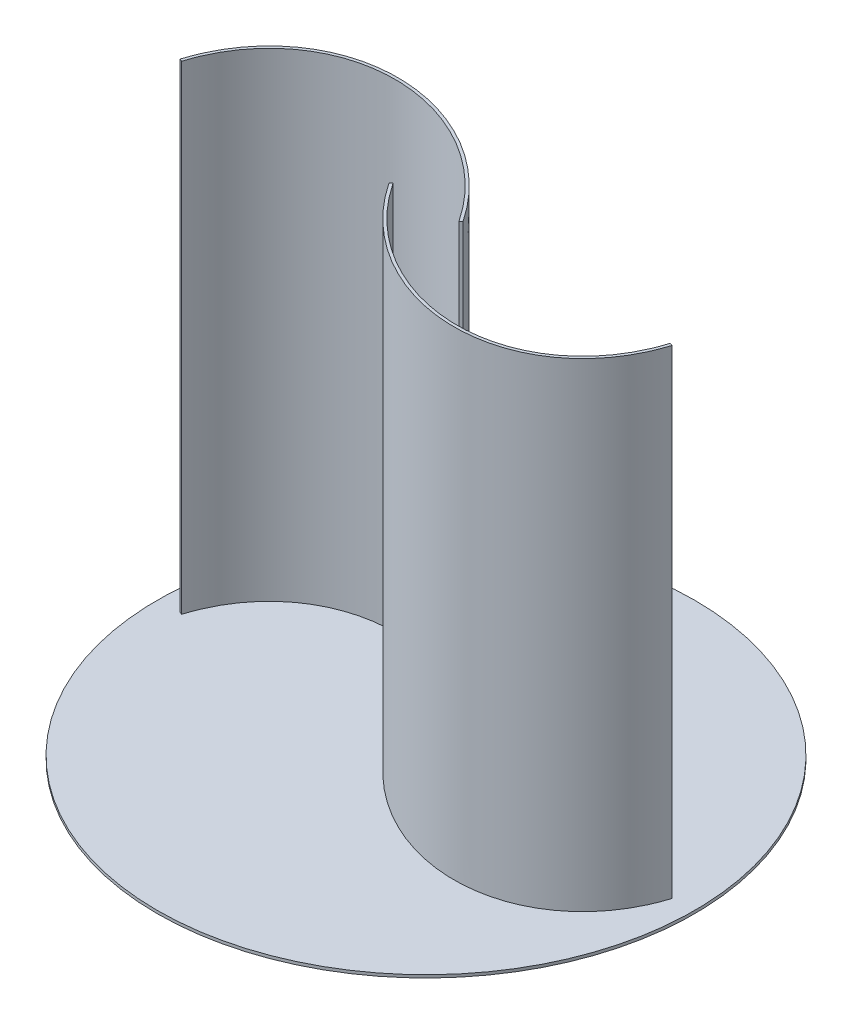
ISO-10303-21;
HEADER;
FILE_DESCRIPTION(('STEP AP214'),'2;1');
FILE_NAME('part.step','',(''),(''),'','','');
FILE_SCHEMA(('AUTOMOTIVE_DESIGN { 1 0 10303 214 1 1 1 1 }'));
ENDSEC;
DATA;
#1=APPLICATION_CONTEXT('core data for automotive mechanical design processes');
#2=APPLICATION_PROTOCOL_DEFINITION('international standard','automotive_design',2000,#1);
#3=PRODUCT_CONTEXT('',#1,'mechanical');
#4=PRODUCT('Part','Part','',(#3));
#5=PRODUCT_RELATED_PRODUCT_CATEGORY('part','',(#4));
#6=PRODUCT_DEFINITION_FORMATION('','',#4);
#7=PRODUCT_DEFINITION_CONTEXT('part definition',#1,'design');
#8=PRODUCT_DEFINITION('design','',#6,#7);
#9=PRODUCT_DEFINITION_SHAPE('','',#8);
#10=(LENGTH_UNIT() NAMED_UNIT(*) SI_UNIT(.MILLI.,.METRE.));
#11=(NAMED_UNIT(*) PLANE_ANGLE_UNIT() SI_UNIT($,.RADIAN.));
#12=(NAMED_UNIT(*) SI_UNIT($,.STERADIAN.) SOLID_ANGLE_UNIT());
#13=UNCERTAINTY_MEASURE_WITH_UNIT(LENGTH_MEASURE(1.E-05),#10,'distance_accuracy_value','');
#14=(GEOMETRIC_REPRESENTATION_CONTEXT(3) GLOBAL_UNCERTAINTY_ASSIGNED_CONTEXT((#13)) GLOBAL_UNIT_ASSIGNED_CONTEXT((#10,
#11,#12)) REPRESENTATION_CONTEXT('',''));
#15=CARTESIAN_POINT('',(0.,0.,0.));
#16=DIRECTION('',(0.,0.,1.));
#17=DIRECTION('',(1.,0.,0.));
#18=AXIS2_PLACEMENT_3D('',#15,#16,#17);
#19=CARTESIAN_POINT('',(0.,0.,0.));
#20=DIRECTION('',(0.,-1.,0.));
#21=DIRECTION('',(0.,0.,-1.));
#22=AXIS2_PLACEMENT_3D('',#19,#20,#21);
#23=PLANE('',#22);
#24=CARTESIAN_POINT('',(0.,0.,0.));
#25=DIRECTION('',(0.,-1.,0.));
#26=DIRECTION('',(0.,0.,-1.));
#27=AXIS2_PLACEMENT_3D('',#24,#25,#26);
#28=CIRCLE('',#27,280.5);
#29=CARTESIAN_POINT('',(0.,0.,-280.5));
#30=VERTEX_POINT('',#29);
#31=EDGE_CURVE('E133',#30,#30,#28,.T.);
#32=ORIENTED_EDGE('',*,*,#31,.F.);
#33=EDGE_LOOP('',(#32));
#34=FACE_BOUND('',#33,.T.);
#35=CARTESIAN_POINT('',(36.9223833949054,0.,-1.66225033579514));
#36=CARTESIAN_POINT('',(32.1145448737323,0.,-8.88560041105333));
#37=CARTESIAN_POINT('',(26.9057075588339,0.,-15.8486757948092));
#38=CARTESIAN_POINT('',(15.7797891104791,0.,-29.1287346442623));
#39=CARTESIAN_POINT('',(9.86276594350617,0.,-35.4456489187779));
#40=CARTESIAN_POINT('',(-2.5732099280169,0.,-47.3190178128574));
#41=CARTESIAN_POINT('',(-9.09209868150903,0.,-52.8754110669405));
#42=CARTESIAN_POINT('',(-22.6148675451389,0.,-63.126659855601));
#43=CARTESIAN_POINT('',(-29.6186799302953,0.,-67.8214627617948));
#44=CARTESIAN_POINT('',(-43.9857181311514,0.,-76.2634551352371));
#45=CARTESIAN_POINT('',(-51.3488748683971,0.,-80.0106006310496));
#46=CARTESIAN_POINT('',(-66.3024456009143,0.,-86.4876522935036));
#47=CARTESIAN_POINT('',(-73.8927911983566,0.,-89.2175217011221));
#48=CARTESIAN_POINT('',(-89.1640743874773,0.,-93.6080489411739));
#49=CARTESIAN_POINT('',(-96.844944697979,0.,-95.2686743866091));
#50=CARTESIAN_POINT('',(-112.158137305376,0.,-97.4874201525338));
#51=CARTESIAN_POINT('',(-119.790390591836,0.,-98.0455093656684));
#52=CARTESIAN_POINT('',(-134.866763518416,0.,-98.0455093656684));
#53=CARTESIAN_POINT('',(-142.310805471188,0.,-97.4873901669953));
#54=CARTESIAN_POINT('',(-156.872894422027,0.,-95.2618416541669));
#55=CARTESIAN_POINT('',(-163.990846834994,0.,-93.5943906086649));
#56=CARTESIAN_POINT('',(-177.767174384892,0.,-89.1784010023347));
#57=CARTESIAN_POINT('',(-184.425436499561,0.,-86.4298642157199));
#58=CARTESIAN_POINT('',(-197.156200496992,0.,-79.9016439348217));
#59=CARTESIAN_POINT('',(-203.228583716785,0.,-76.1220007985467));
#60=CARTESIAN_POINT('',(-214.672346426108,0.,-67.6026451692365));
#61=CARTESIAN_POINT('',(-220.043625089779,0.,-62.8630128039617));
#62=CARTESIAN_POINT('',(-229.984260691079,0.,-52.5140707922798));
#63=CARTESIAN_POINT('',(-234.553552685352,0.,-46.9048642235047));
#64=CARTESIAN_POINT('',(-242.80616441977,0.,-34.9236545132171));
#65=CARTESIAN_POINT('',(-246.489455429961,0.,-28.5517550158839));
#66=CARTESIAN_POINT('',(-252.90427123467,0.,-15.1653455376847));
#67=CARTESIAN_POINT('',(-255.635790383931,0.,-8.15092709936019));
#68=CARTESIAN_POINT('',(-257.867887256391,0.,-0.880467310369004));
#69=B_SPLINE_CURVE_WITH_KNOTS('',3,(#35,#36,#37,#38,#39,#40,#41,#42,#43,#44,#45,#46,#47,#48,#49,
#50,#51,#52,#53,#54,#55,#56,#57,#58,#59,#60,#61,#62,#63,#64,#65,#66,#67,#68),.UNSPECIFIED.,.F.,
.F.,(4,2,2,2,2,2,2,2,2,2,2,2,2,2,2,2,4),(0.,0.0625,0.125,0.1875,0.25,0.3125,0.375,0.4375,0.5,
0.5625,0.625,0.6875,0.75,0.8125,0.875,0.9375,1.),.UNSPECIFIED.);
#70=CARTESIAN_POINT('',(36.9223833949054,0.,-1.66225033579514));
#71=VERTEX_POINT('',#70);
#72=CARTESIAN_POINT('',(-257.867887256391,0.,-0.880467310369074));
#73=VERTEX_POINT('',#72);
#74=EDGE_CURVE('E187',#71,#73,#69,.T.);
#75=ORIENTED_EDGE('',*,*,#74,.F.);
#76=DIRECTION('',(-0.832461131635115,0.,0.554083445265047));
#77=VECTOR('',#76,1.);
#78=CARTESIAN_POINT('',(36.9223833949054,0.,-1.66225033579514));
#79=LINE('',#78,#77);
#80=CARTESIAN_POINT('',(34.425,0.,0.));
#81=VERTEX_POINT('',#80);
#82=EDGE_CURVE('E201',#71,#81,#79,.T.);
#83=ORIENTED_EDGE('',*,*,#82,.T.);
#84=CARTESIAN_POINT('',(-95.2187468701049,0.,84.0449997440507));
#85=DIRECTION('',(0.,1.,0.));
#86=DIRECTION('',(0.573576436351044,0.,0.819152044288993));
#87=AXIS2_PLACEMENT_3D('',#84,#85,#86);
#88=ELLIPSE('',#87,190.,154.469256869804);
#89=CARTESIAN_POINT('',(-255.,0.,0.));
#90=VERTEX_POINT('',#89);
#91=EDGE_CURVE('E198',#81,#90,#88,.T.);
#92=ORIENTED_EDGE('',*,*,#91,.T.);
#93=DIRECTION('',(-0.955962418797095,0.,-0.293489103456341));
#94=VECTOR('',#93,1.);
#95=CARTESIAN_POINT('',(-255.,0.,0.));
#96=LINE('',#95,#94);
#97=EDGE_CURVE('E191',#90,#73,#96,.T.);
#98=ORIENTED_EDGE('',*,*,#97,.T.);
#99=EDGE_LOOP('',(#75,#83,#92,#98));
#100=FACE_BOUND('',#99,.T.);
#101=CARTESIAN_POINT('',(-36.9223833949054,0.,1.66225033579517));
#102=CARTESIAN_POINT('',(-32.1145448737323,0.,8.88560041105338));
#103=CARTESIAN_POINT('',(-26.9057075588339,0.,15.8486757948092));
#104=CARTESIAN_POINT('',(-15.7797891104791,0.,29.1287346442624));
#105=CARTESIAN_POINT('',(-9.86276594350612,0.,35.445648918778));
#106=CARTESIAN_POINT('',(2.57320992801696,0.,47.3190178128575));
#107=CARTESIAN_POINT('',(9.09209868150902,0.,52.8754110669405));
#108=CARTESIAN_POINT('',(22.6148675451388,0.,63.1266598556011));
#109=CARTESIAN_POINT('',(29.6186799302954,0.,67.8214627617949));
#110=CARTESIAN_POINT('',(43.9857181311515,0.,76.2634551352372));
#111=CARTESIAN_POINT('',(51.3488748683971,0.,80.0106006310497));
#112=CARTESIAN_POINT('',(66.3024456009142,0.,86.4876522935037));
#113=CARTESIAN_POINT('',(73.8927911983566,0.,89.2175217011222));
#114=CARTESIAN_POINT('',(89.1640743874773,0.,93.608048941174));
#115=CARTESIAN_POINT('',(96.8449446979791,0.,95.2686743866092));
#116=CARTESIAN_POINT('',(112.158137305376,0.,97.4874201525339));
#117=CARTESIAN_POINT('',(119.790390591836,0.,98.0455093656685));
#118=CARTESIAN_POINT('',(134.866763518416,0.,98.0455093656685));
#119=CARTESIAN_POINT('',(142.310805471188,0.,97.4873901669954));
#120=CARTESIAN_POINT('',(156.872894422027,0.,95.261841654167));
#121=CARTESIAN_POINT('',(163.990846834994,0.,93.5943906086651));
#122=CARTESIAN_POINT('',(177.767174384892,0.,89.1784010023348));
#123=CARTESIAN_POINT('',(184.425436499561,0.,86.42986421572));
#124=CARTESIAN_POINT('',(197.156200496992,0.,79.9016439348218));
#125=CARTESIAN_POINT('',(203.228583716785,0.,76.1220007985468));
#126=CARTESIAN_POINT('',(214.672346426109,0.,67.6026451692367));
#127=CARTESIAN_POINT('',(220.04362508978,0.,62.8630128039618));
#128=CARTESIAN_POINT('',(229.984260691079,0.,52.5140707922798));
#129=CARTESIAN_POINT('',(234.553552685352,0.,46.9048642235048));
#130=CARTESIAN_POINT('',(242.806164419771,0.,34.9236545132172));
#131=CARTESIAN_POINT('',(246.489455429961,0.,28.551755015884));
#132=CARTESIAN_POINT('',(252.90427123467,0.,15.1653455376848));
#133=CARTESIAN_POINT('',(255.635790383931,0.,8.15092709936034));
#134=CARTESIAN_POINT('',(257.867887256391,0.,0.880467310369101));
#135=B_SPLINE_CURVE_WITH_KNOTS('',3,(#101,#102,#103,#104,#105,#106,#107,#108,#109,#110,#111,
#112,#113,#114,#115,#116,#117,#118,#119,#120,#121,#122,#123,#124,#125,#126,#127,#128,#129,#130,
#131,#132,#133,#134),.UNSPECIFIED.,.F.,.F.,(4,2,2,2,2,2,2,2,2,2,2,2,2,2,2,2,4),(0.,0.0625,0.125,
0.1875,0.25,0.3125,0.375,0.4375,0.5,0.5625,0.625,0.6875,0.75,0.8125,0.875,0.9375,1.),.UNSPECIFIED.);
#136=CARTESIAN_POINT('',(-36.9223833949054,0.,1.66225033579517));
#137=VERTEX_POINT('',#136);
#138=CARTESIAN_POINT('',(257.867887256391,0.,0.880467310369171));
#139=VERTEX_POINT('',#138);
#140=EDGE_CURVE('E129',#137,#139,#135,.T.);
#141=ORIENTED_EDGE('',*,*,#140,.F.);
#142=DIRECTION('',(0.832461131635115,0.,-0.554083445265047));
#143=VECTOR('',#142,1.);
#144=CARTESIAN_POINT('',(-36.9223833949054,0.,1.66225033579517));
#145=LINE('',#144,#143);
#146=CARTESIAN_POINT('',(-34.425,0.,0.));
#147=VERTEX_POINT('',#146);
#148=EDGE_CURVE('E123',#137,#147,#145,.T.);
#149=ORIENTED_EDGE('',*,*,#148,.T.);
#150=CARTESIAN_POINT('',(95.218746870105,0.,-84.0449997440507));
#151=DIRECTION('',(0.,1.,0.));
#152=DIRECTION('',(-0.573576436351045,0.,-0.819152044288993));
#153=AXIS2_PLACEMENT_3D('',#150,#151,#152);
#154=ELLIPSE('',#153,190.,154.469256869804);
#155=CARTESIAN_POINT('',(255.,0.,1.11022302462516E-13));
#156=VERTEX_POINT('',#155);
#157=EDGE_CURVE('E55',#147,#156,#154,.T.);
#158=ORIENTED_EDGE('',*,*,#157,.T.);
#159=DIRECTION('',(0.955962418797093,0.,0.29348910345635));
#160=VECTOR('',#159,1.);
#161=CARTESIAN_POINT('',(255.,0.,1.11022302462516E-13));
#162=LINE('',#161,#160);
#163=EDGE_CURVE('E233',#156,#139,#162,.T.);
#164=ORIENTED_EDGE('',*,*,#163,.T.);
#165=EDGE_LOOP('',(#141,#149,#158,#164));
#166=FACE_BOUND('',#165,.T.);
#167=ADVANCED_FACE('F39',(#34,#100,#166),#23,.F.);
#168=CARTESIAN_POINT('',(36.9223833949054,500.,-1.66225033579514));
#169=CARTESIAN_POINT('',(32.1145448737323,500.,-8.88560041105333));
#170=CARTESIAN_POINT('',(26.9057075588339,500.,-15.8486757948092));
#171=CARTESIAN_POINT('',(15.7797891104791,500.,-29.1287346442623));
#172=CARTESIAN_POINT('',(9.86276594350617,500.,-35.4456489187779));
#173=CARTESIAN_POINT('',(-2.5732099280169,500.,-47.3190178128574));
#174=CARTESIAN_POINT('',(-9.09209868150903,500.,-52.8754110669405));
#175=CARTESIAN_POINT('',(-22.6148675451389,500.,-63.126659855601));
#176=CARTESIAN_POINT('',(-29.6186799302953,500.,-67.8214627617948));
#177=CARTESIAN_POINT('',(-43.9857181311514,500.,-76.2634551352371));
#178=CARTESIAN_POINT('',(-51.3488748683971,500.,-80.0106006310496));
#179=CARTESIAN_POINT('',(-66.3024456009143,500.,-86.4876522935036));
#180=CARTESIAN_POINT('',(-73.8927911983566,500.,-89.2175217011221));
#181=CARTESIAN_POINT('',(-89.1640743874773,500.,-93.6080489411739));
#182=CARTESIAN_POINT('',(-96.844944697979,500.,-95.2686743866091));
#183=CARTESIAN_POINT('',(-112.158137305376,500.,-97.4874201525338));
#184=CARTESIAN_POINT('',(-119.790390591836,500.,-98.0455093656684));
#185=CARTESIAN_POINT('',(-134.866763518416,500.,-98.0455093656684));
#186=CARTESIAN_POINT('',(-142.310805471188,500.,-97.4873901669953));
#187=CARTESIAN_POINT('',(-156.872894422027,500.,-95.2618416541669));
#188=CARTESIAN_POINT('',(-163.990846834994,500.,-93.5943906086649));
#189=CARTESIAN_POINT('',(-177.767174384892,500.,-89.1784010023347));
#190=CARTESIAN_POINT('',(-184.425436499561,500.,-86.4298642157199));
#191=CARTESIAN_POINT('',(-197.156200496992,500.,-79.9016439348217));
#192=CARTESIAN_POINT('',(-203.228583716785,500.,-76.1220007985467));
#193=CARTESIAN_POINT('',(-214.672346426108,500.,-67.6026451692365));
#194=CARTESIAN_POINT('',(-220.043625089779,500.,-62.8630128039617));
#195=CARTESIAN_POINT('',(-229.984260691079,500.,-52.5140707922798));
#196=CARTESIAN_POINT('',(-234.553552685352,500.,-46.9048642235047));
#197=CARTESIAN_POINT('',(-242.80616441977,500.,-34.9236545132171));
#198=CARTESIAN_POINT('',(-246.489455429961,500.,-28.5517550158839));
#199=CARTESIAN_POINT('',(-252.90427123467,500.,-15.1653455376847));
#200=CARTESIAN_POINT('',(-255.635790383931,500.,-8.15092709936019));
#201=CARTESIAN_POINT('',(-257.867887256391,500.,-0.880467310369004));
#202=B_SPLINE_CURVE_WITH_KNOTS('',3,(#168,#169,#170,#171,#172,#173,#174,#175,#176,#177,#178,
#179,#180,#181,#182,#183,#184,#185,#186,#187,#188,#189,#190,#191,#192,#193,#194,#195,#196,#197,
#198,#199,#200,#201),.UNSPECIFIED.,.F.,.F.,(4,2,2,2,2,2,2,2,2,2,2,2,2,2,2,2,4),(0.,0.0625,0.125,
0.1875,0.25,0.3125,0.375,0.4375,0.5,0.5625,0.625,0.6875,0.75,0.8125,0.875,0.9375,1.),.UNSPECIFIED.);
#203=DIRECTION('',(0.,-1.,0.));
#204=VECTOR('',#203,1.);
#205=SURFACE_OF_LINEAR_EXTRUSION('',#202,#204);
#206=ORIENTED_EDGE('',*,*,#74,.T.);
#207=DIRECTION('',(0.,-1.,0.));
#208=VECTOR('',#207,1.);
#209=CARTESIAN_POINT('',(-257.867887256391,500.,-0.880467310369074));
#210=LINE('',#209,#208);
#211=CARTESIAN_POINT('',(-257.867887256391,500.,-0.880467310369074));
#212=VERTEX_POINT('',#211);
#213=EDGE_CURVE('E11',#212,#73,#210,.T.);
#214=ORIENTED_EDGE('',*,*,#213,.F.);
#215=CARTESIAN_POINT('',(36.9223833949054,500.,-1.66225033579514));
#216=VERTEX_POINT('',#215);
#217=EDGE_CURVE('E86',#216,#212,#202,.T.);
#218=ORIENTED_EDGE('',*,*,#217,.F.);
#219=DIRECTION('',(0.,-1.,0.));
#220=VECTOR('',#219,1.);
#221=CARTESIAN_POINT('',(36.9223833949054,500.,-1.66225033579514));
#222=LINE('',#221,#220);
#223=EDGE_CURVE('E64',#216,#71,#222,.T.);
#224=ORIENTED_EDGE('',*,*,#223,.T.);
#225=EDGE_LOOP('',(#206,#214,#218,#224));
#226=FACE_BOUND('',#225,.T.);
#227=ADVANCED_FACE('F41',(#226),#205,.F.);
#228=CARTESIAN_POINT('',(-255.,500.,0.));
#229=DIRECTION('',(-0.293489103456341,0.,0.955962418797095));
#230=DIRECTION('',(0.955962418797095,0.,0.293489103456341));
#231=AXIS2_PLACEMENT_3D('',#228,#229,#230);
#232=PLANE('',#231);
#233=ORIENTED_EDGE('',*,*,#97,.F.);
#234=DIRECTION('',(0.,-1.,0.));
#235=VECTOR('',#234,1.);
#236=CARTESIAN_POINT('',(-255.,500.,0.));
#237=LINE('',#236,#235);
#238=CARTESIAN_POINT('',(-255.,500.,0.));
#239=VERTEX_POINT('',#238);
#240=EDGE_CURVE('E48',#239,#90,#237,.T.);
#241=ORIENTED_EDGE('',*,*,#240,.F.);
#242=DIRECTION('',(-0.955962418797095,0.,-0.293489103456341));
#243=VECTOR('',#242,1.);
#244=CARTESIAN_POINT('',(-255.,500.,0.));
#245=LINE('',#244,#243);
#246=EDGE_CURVE('E185',#239,#212,#245,.T.);
#247=ORIENTED_EDGE('',*,*,#246,.T.);
#248=ORIENTED_EDGE('',*,*,#213,.T.);
#249=EDGE_LOOP('',(#233,#241,#247,#248));
#250=FACE_BOUND('',#249,.T.);
#251=ADVANCED_FACE('F177',(#250),#232,.T.);
#252=CARTESIAN_POINT('',(-95.2187468701049,500.,84.0449997440507));
#253=DIRECTION('',(0.,1.,0.));
#254=DIRECTION('',(0.573576436351044,0.,0.819152044288993));
#255=AXIS2_PLACEMENT_3D('',#252,#253,#254);
#256=ELLIPSE('',#255,190.,154.469256869804);
#257=DIRECTION('',(0.,-1.,0.));
#258=VECTOR('',#257,1.);
#259=SURFACE_OF_LINEAR_EXTRUSION('',#256,#258);
#260=ORIENTED_EDGE('',*,*,#91,.F.);
#261=DIRECTION('',(0.,-1.,0.));
#262=VECTOR('',#261,1.);
#263=CARTESIAN_POINT('',(34.425,500.,0.));
#264=LINE('',#263,#262);
#265=CARTESIAN_POINT('',(34.425,500.,0.));
#266=VERTEX_POINT('',#265);
#267=EDGE_CURVE('E205',#266,#81,#264,.T.);
#268=ORIENTED_EDGE('',*,*,#267,.F.);
#269=EDGE_CURVE('E179',#266,#239,#256,.T.);
#270=ORIENTED_EDGE('',*,*,#269,.T.);
#271=ORIENTED_EDGE('',*,*,#240,.T.);
#272=EDGE_LOOP('',(#260,#268,#270,#271));
#273=FACE_BOUND('',#272,.T.);
#274=ADVANCED_FACE('F174',(#273),#259,.T.);
#275=CARTESIAN_POINT('',(36.9223833949054,500.,-1.66225033579514));
#276=DIRECTION('',(0.554083445265047,0.,0.832461131635115));
#277=DIRECTION('',(0.832461131635115,0.,-0.554083445265047));
#278=AXIS2_PLACEMENT_3D('',#275,#276,#277);
#279=PLANE('',#278);
#280=ORIENTED_EDGE('',*,*,#82,.F.);
#281=ORIENTED_EDGE('',*,*,#223,.F.);
#282=DIRECTION('',(-0.832461131635115,0.,0.554083445265047));
#283=VECTOR('',#282,1.);
#284=CARTESIAN_POINT('',(36.9223833949054,500.,-1.66225033579514));
#285=LINE('',#284,#283);
#286=EDGE_CURVE('E184',#216,#266,#285,.T.);
#287=ORIENTED_EDGE('',*,*,#286,.T.);
#288=ORIENTED_EDGE('',*,*,#267,.T.);
#289=EDGE_LOOP('',(#280,#281,#287,#288));
#290=FACE_BOUND('',#289,.T.);
#291=ADVANCED_FACE('F171',(#290),#279,.T.);
#292=CARTESIAN_POINT('',(-127.328577055126,500.,-98.0455093656684));
#293=DIRECTION('',(0.,-1.,0.));
#294=DIRECTION('',(-1.,0.,0.));
#295=AXIS2_PLACEMENT_3D('',#292,#293,#294);
#296=PLANE('',#295);
#297=ORIENTED_EDGE('',*,*,#217,.T.);
#298=ORIENTED_EDGE('',*,*,#246,.F.);
#299=ORIENTED_EDGE('',*,*,#269,.F.);
#300=ORIENTED_EDGE('',*,*,#286,.F.);
#301=EDGE_LOOP('',(#297,#298,#299,#300));
#302=FACE_BOUND('',#301,.T.);
#303=ADVANCED_FACE('F167',(#302),#296,.F.);
#304=CARTESIAN_POINT('',(0.,-3.,0.));
#305=DIRECTION('',(0.,1.,0.));
#306=DIRECTION('',(0.,0.,1.));
#307=AXIS2_PLACEMENT_3D('',#304,#305,#306);
#308=CYLINDRICAL_SURFACE('',#307,280.5);
#309=CARTESIAN_POINT('',(0.,-3.,0.));
#310=DIRECTION('',(0.,-1.,0.));
#311=DIRECTION('',(0.,0.,-1.));
#312=AXIS2_PLACEMENT_3D('',#309,#310,#311);
#313=CIRCLE('',#312,280.5);
#314=CARTESIAN_POINT('',(0.,-3.,-280.5));
#315=VERTEX_POINT('',#314);
#316=EDGE_CURVE('E192',#315,#315,#313,.T.);
#317=ORIENTED_EDGE('',*,*,#316,.F.);
#318=EDGE_LOOP('',(#317));
#319=FACE_BOUND('',#318,.T.);
#320=ORIENTED_EDGE('',*,*,#31,.T.);
#321=EDGE_LOOP('',(#320));
#322=FACE_BOUND('',#321,.T.);
#323=ADVANCED_FACE('F160',(#319,#322),#308,.T.);
#324=CARTESIAN_POINT('',(0.,-3.,0.));
#325=DIRECTION('',(0.,-1.,0.));
#326=DIRECTION('',(0.,0.,-1.));
#327=AXIS2_PLACEMENT_3D('',#324,#325,#326);
#328=PLANE('',#327);
#329=ORIENTED_EDGE('',*,*,#316,.T.);
#330=EDGE_LOOP('',(#329));
#331=FACE_BOUND('',#330,.T.);
#332=ADVANCED_FACE('F157',(#331),#328,.T.);
#333=CARTESIAN_POINT('',(-36.9223833949054,500.,1.66225033579517));
#334=CARTESIAN_POINT('',(-32.1145448737323,500.,8.88560041105338));
#335=CARTESIAN_POINT('',(-26.9057075588339,500.,15.8486757948092));
#336=CARTESIAN_POINT('',(-15.7797891104791,500.,29.1287346442624));
#337=CARTESIAN_POINT('',(-9.86276594350612,500.,35.445648918778));
#338=CARTESIAN_POINT('',(2.57320992801696,500.,47.3190178128575));
#339=CARTESIAN_POINT('',(9.09209868150902,500.,52.8754110669405));
#340=CARTESIAN_POINT('',(22.6148675451388,500.,63.1266598556011));
#341=CARTESIAN_POINT('',(29.6186799302954,500.,67.8214627617949));
#342=CARTESIAN_POINT('',(43.9857181311515,500.,76.2634551352372));
#343=CARTESIAN_POINT('',(51.3488748683971,500.,80.0106006310497));
#344=CARTESIAN_POINT('',(66.3024456009142,500.,86.4876522935037));
#345=CARTESIAN_POINT('',(73.8927911983566,500.,89.2175217011222));
#346=CARTESIAN_POINT('',(89.1640743874773,500.,93.608048941174));
#347=CARTESIAN_POINT('',(96.8449446979791,500.,95.2686743866092));
#348=CARTESIAN_POINT('',(112.158137305376,500.,97.4874201525339));
#349=CARTESIAN_POINT('',(119.790390591836,500.,98.0455093656685));
#350=CARTESIAN_POINT('',(134.866763518416,500.,98.0455093656685));
#351=CARTESIAN_POINT('',(142.310805471188,500.,97.4873901669954));
#352=CARTESIAN_POINT('',(156.872894422027,500.,95.261841654167));
#353=CARTESIAN_POINT('',(163.990846834994,500.,93.5943906086651));
#354=CARTESIAN_POINT('',(177.767174384892,500.,89.1784010023348));
#355=CARTESIAN_POINT('',(184.425436499561,500.,86.42986421572));
#356=CARTESIAN_POINT('',(197.156200496992,500.,79.9016439348218));
#357=CARTESIAN_POINT('',(203.228583716785,500.,76.1220007985468));
#358=CARTESIAN_POINT('',(214.672346426109,500.,67.6026451692367));
#359=CARTESIAN_POINT('',(220.04362508978,500.,62.8630128039618));
#360=CARTESIAN_POINT('',(229.984260691079,500.,52.5140707922798));
#361=CARTESIAN_POINT('',(234.553552685352,500.,46.9048642235048));
#362=CARTESIAN_POINT('',(242.806164419771,500.,34.9236545132172));
#363=CARTESIAN_POINT('',(246.489455429961,500.,28.551755015884));
#364=CARTESIAN_POINT('',(252.90427123467,500.,15.1653455376848));
#365=CARTESIAN_POINT('',(255.635790383931,500.,8.15092709936034));
#366=CARTESIAN_POINT('',(257.867887256391,500.,0.880467310369101));
#367=B_SPLINE_CURVE_WITH_KNOTS('',3,(#333,#334,#335,#336,#337,#338,#339,#340,#341,#342,#343,
#344,#345,#346,#347,#348,#349,#350,#351,#352,#353,#354,#355,#356,#357,#358,#359,#360,#361,#362,
#363,#364,#365,#366),.UNSPECIFIED.,.F.,.F.,(4,2,2,2,2,2,2,2,2,2,2,2,2,2,2,2,4),(0.,0.0625,0.125,
0.1875,0.25,0.3125,0.375,0.4375,0.5,0.5625,0.625,0.6875,0.75,0.8125,0.875,0.9375,1.),.UNSPECIFIED.);
#368=DIRECTION('',(0.,-1.,0.));
#369=VECTOR('',#368,1.);
#370=SURFACE_OF_LINEAR_EXTRUSION('',#367,#369);
#371=ORIENTED_EDGE('',*,*,#140,.T.);
#372=DIRECTION('',(0.,-1.,0.));
#373=VECTOR('',#372,1.);
#374=CARTESIAN_POINT('',(257.867887256391,500.,0.880467310369171));
#375=LINE('',#374,#373);
#376=CARTESIAN_POINT('',(257.867887256391,500.,0.880467310369171));
#377=VERTEX_POINT('',#376);
#378=EDGE_CURVE('E126',#377,#139,#375,.T.);
#379=ORIENTED_EDGE('',*,*,#378,.F.);
#380=CARTESIAN_POINT('',(-36.9223833949054,500.,1.66225033579517));
#381=VERTEX_POINT('',#380);
#382=EDGE_CURVE('E113',#381,#377,#367,.T.);
#383=ORIENTED_EDGE('',*,*,#382,.F.);
#384=DIRECTION('',(0.,-1.,0.));
#385=VECTOR('',#384,1.);
#386=CARTESIAN_POINT('',(-36.9223833949054,500.,1.66225033579517));
#387=LINE('',#386,#385);
#388=EDGE_CURVE('E228',#381,#137,#387,.T.);
#389=ORIENTED_EDGE('',*,*,#388,.T.);
#390=EDGE_LOOP('',(#371,#379,#383,#389));
#391=FACE_BOUND('',#390,.T.);
#392=ADVANCED_FACE('F127',(#391),#370,.F.);
#393=CARTESIAN_POINT('',(255.,500.,1.11022302462516E-13));
#394=DIRECTION('',(0.29348910345635,0.,-0.955962418797093));
#395=DIRECTION('',(-0.955962418797093,0.,-0.29348910345635));
#396=AXIS2_PLACEMENT_3D('',#393,#394,#395);
#397=PLANE('',#396);
#398=ORIENTED_EDGE('',*,*,#163,.F.);
#399=DIRECTION('',(0.,-1.,0.));
#400=VECTOR('',#399,1.);
#401=CARTESIAN_POINT('',(255.,500.,1.11022302462516E-13));
#402=LINE('',#401,#400);
#403=CARTESIAN_POINT('',(255.,500.,1.11022302462516E-13));
#404=VERTEX_POINT('',#403);
#405=EDGE_CURVE('E134',#404,#156,#402,.T.);
#406=ORIENTED_EDGE('',*,*,#405,.F.);
#407=DIRECTION('',(0.955962418797093,0.,0.29348910345635));
#408=VECTOR('',#407,1.);
#409=CARTESIAN_POINT('',(255.,500.,1.11022302462516E-13));
#410=LINE('',#409,#408);
#411=EDGE_CURVE('E118',#404,#377,#410,.T.);
#412=ORIENTED_EDGE('',*,*,#411,.T.);
#413=ORIENTED_EDGE('',*,*,#378,.T.);
#414=EDGE_LOOP('',(#398,#406,#412,#413));
#415=FACE_BOUND('',#414,.T.);
#416=ADVANCED_FACE('F136',(#415),#397,.T.);
#417=CARTESIAN_POINT('',(95.218746870105,500.,-84.0449997440507));
#418=DIRECTION('',(0.,1.,0.));
#419=DIRECTION('',(-0.573576436351045,0.,-0.819152044288993));
#420=AXIS2_PLACEMENT_3D('',#417,#418,#419);
#421=ELLIPSE('',#420,190.,154.469256869804);
#422=DIRECTION('',(0.,-1.,0.));
#423=VECTOR('',#422,1.);
#424=SURFACE_OF_LINEAR_EXTRUSION('',#421,#423);
#425=ORIENTED_EDGE('',*,*,#157,.F.);
#426=DIRECTION('',(0.,-1.,0.));
#427=VECTOR('',#426,1.);
#428=CARTESIAN_POINT('',(-34.425,500.,0.));
#429=LINE('',#428,#427);
#430=CARTESIAN_POINT('',(-34.425,500.,0.));
#431=VERTEX_POINT('',#430);
#432=EDGE_CURVE('E226',#431,#147,#429,.T.);
#433=ORIENTED_EDGE('',*,*,#432,.F.);
#434=EDGE_CURVE('E137',#431,#404,#421,.T.);
#435=ORIENTED_EDGE('',*,*,#434,.T.);
#436=ORIENTED_EDGE('',*,*,#405,.T.);
#437=EDGE_LOOP('',(#425,#433,#435,#436));
#438=FACE_BOUND('',#437,.T.);
#439=ADVANCED_FACE('F147',(#438),#424,.T.);
#440=CARTESIAN_POINT('',(-36.9223833949054,500.,1.66225033579517));
#441=DIRECTION('',(-0.554083445265047,0.,-0.832461131635115));
#442=DIRECTION('',(-0.832461131635115,0.,0.554083445265047));
#443=AXIS2_PLACEMENT_3D('',#440,#441,#442);
#444=PLANE('',#443);
#445=ORIENTED_EDGE('',*,*,#148,.F.);
#446=ORIENTED_EDGE('',*,*,#388,.F.);
#447=DIRECTION('',(0.832461131635115,0.,-0.554083445265047));
#448=VECTOR('',#447,1.);
#449=CARTESIAN_POINT('',(-36.9223833949054,500.,1.66225033579517));
#450=LINE('',#449,#448);
#451=EDGE_CURVE('E121',#381,#431,#450,.T.);
#452=ORIENTED_EDGE('',*,*,#451,.T.);
#453=ORIENTED_EDGE('',*,*,#432,.T.);
#454=EDGE_LOOP('',(#445,#446,#452,#453));
#455=FACE_BOUND('',#454,.T.);
#456=ADVANCED_FACE('F151',(#455),#444,.T.);
#457=CARTESIAN_POINT('',(127.328577055126,500.,98.0455093656685));
#458=DIRECTION('',(0.,-1.,0.));
#459=DIRECTION('',(-1.,0.,0.));
#460=AXIS2_PLACEMENT_3D('',#457,#458,#459);
#461=PLANE('',#460);
#462=ORIENTED_EDGE('',*,*,#382,.T.);
#463=ORIENTED_EDGE('',*,*,#411,.F.);
#464=ORIENTED_EDGE('',*,*,#434,.F.);
#465=ORIENTED_EDGE('',*,*,#451,.F.);
#466=EDGE_LOOP('',(#462,#463,#464,#465));
#467=FACE_BOUND('',#466,.T.);
#468=ADVANCED_FACE('F115',(#467),#461,.F.);
#469=CLOSED_SHELL('',(#167,#227,#251,#274,#291,#303,#323,#332,#392,#416,#439,#456,#468));
#470=MANIFOLD_SOLID_BREP('B2',#469);
#471=ADVANCED_BREP_SHAPE_REPRESENTATION('',(#18,#470),#14);
#472=SHAPE_DEFINITION_REPRESENTATION(#9,#471);
ENDSEC;
END-ISO-10303-21;
